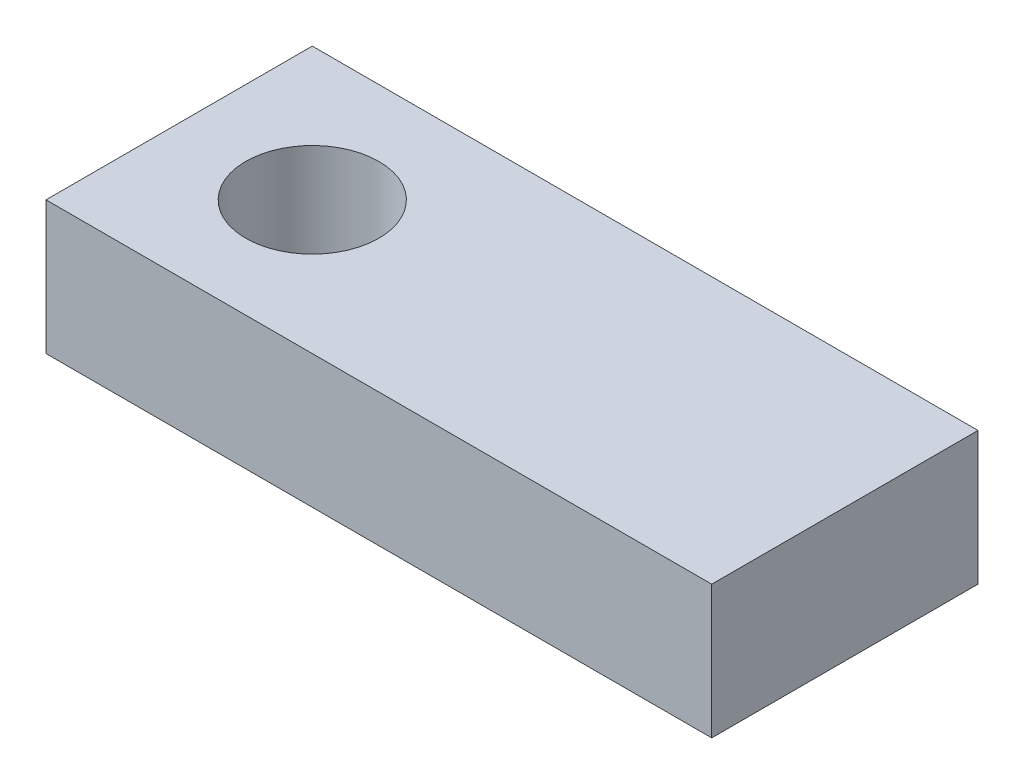
ISO-10303-21;
HEADER;
FILE_DESCRIPTION(('STEP AP214'),'2;1');
FILE_NAME('part.step','',(''),(''),'','','');
FILE_SCHEMA(('AUTOMOTIVE_DESIGN { 1 0 10303 214 1 1 1 1 }'));
ENDSEC;
DATA;
#1=APPLICATION_CONTEXT('core data for automotive mechanical design processes');
#2=APPLICATION_PROTOCOL_DEFINITION('international standard','automotive_design',2000,#1);
#3=PRODUCT_CONTEXT('',#1,'mechanical');
#4=PRODUCT('Part','Part','',(#3));
#5=PRODUCT_RELATED_PRODUCT_CATEGORY('part','',(#4));
#6=PRODUCT_DEFINITION_FORMATION('','',#4);
#7=PRODUCT_DEFINITION_CONTEXT('part definition',#1,'design');
#8=PRODUCT_DEFINITION('design','',#6,#7);
#9=PRODUCT_DEFINITION_SHAPE('','',#8);
#10=(LENGTH_UNIT() NAMED_UNIT(*) SI_UNIT(.MILLI.,.METRE.));
#11=(NAMED_UNIT(*) PLANE_ANGLE_UNIT() SI_UNIT($,.RADIAN.));
#12=(NAMED_UNIT(*) SI_UNIT($,.STERADIAN.) SOLID_ANGLE_UNIT());
#13=UNCERTAINTY_MEASURE_WITH_UNIT(LENGTH_MEASURE(1.E-05),#10,'distance_accuracy_value','');
#14=(GEOMETRIC_REPRESENTATION_CONTEXT(3) GLOBAL_UNCERTAINTY_ASSIGNED_CONTEXT((#13)) GLOBAL_UNIT_ASSIGNED_CONTEXT((#10,
#11,#12)) REPRESENTATION_CONTEXT('',''));
#15=CARTESIAN_POINT('',(0.,0.,0.));
#16=DIRECTION('',(0.,0.,1.));
#17=DIRECTION('',(1.,0.,0.));
#18=AXIS2_PLACEMENT_3D('',#15,#16,#17);
#19=CARTESIAN_POINT('',(0.,25.4,0.));
#20=DIRECTION('',(1.,0.,0.));
#21=DIRECTION('',(0.,0.,-1.));
#22=AXIS2_PLACEMENT_3D('',#19,#20,#21);
#23=PLANE('',#22);
#24=DIRECTION('',(0.,0.,1.));
#25=VECTOR('',#24,1.);
#26=CARTESIAN_POINT('',(0.,0.,0.));
#27=LINE('',#26,#25);
#28=CARTESIAN_POINT('',(0.,0.,-50.8));
#29=VERTEX_POINT('',#28);
#30=CARTESIAN_POINT('',(0.,0.,0.));
#31=VERTEX_POINT('',#30);
#32=EDGE_CURVE('E97',#29,#31,#27,.T.);
#33=ORIENTED_EDGE('',*,*,#32,.T.);
#34=DIRECTION('',(0.,-1.,0.));
#35=VECTOR('',#34,1.);
#36=CARTESIAN_POINT('',(0.,25.4,0.));
#37=LINE('',#36,#35);
#38=CARTESIAN_POINT('',(0.,25.4,0.));
#39=VERTEX_POINT('',#38);
#40=EDGE_CURVE('E11',#39,#31,#37,.T.);
#41=ORIENTED_EDGE('',*,*,#40,.F.);
#42=DIRECTION('',(0.,0.,1.));
#43=VECTOR('',#42,1.);
#44=CARTESIAN_POINT('',(0.,25.4,0.));
#45=LINE('',#44,#43);
#46=CARTESIAN_POINT('',(0.,25.4,-50.8));
#47=VERTEX_POINT('',#46);
#48=EDGE_CURVE('E85',#47,#39,#45,.T.);
#49=ORIENTED_EDGE('',*,*,#48,.F.);
#50=DIRECTION('',(0.,-1.,0.));
#51=VECTOR('',#50,1.);
#52=CARTESIAN_POINT('',(0.,25.4,-50.8));
#53=LINE('',#52,#51);
#54=EDGE_CURVE('E93',#47,#29,#53,.T.);
#55=ORIENTED_EDGE('',*,*,#54,.T.);
#56=EDGE_LOOP('',(#33,#41,#49,#55));
#57=FACE_BOUND('',#56,.T.);
#58=ADVANCED_FACE('F34',(#57),#23,.F.);
#59=CARTESIAN_POINT('',(0.,25.4,0.));
#60=DIRECTION('',(0.,0.,-1.));
#61=DIRECTION('',(-1.,0.,0.));
#62=AXIS2_PLACEMENT_3D('',#59,#60,#61);
#63=PLANE('',#62);
#64=DIRECTION('',(1.,0.,0.));
#65=VECTOR('',#64,1.);
#66=CARTESIAN_POINT('',(0.,0.,0.));
#67=LINE('',#66,#65);
#68=CARTESIAN_POINT('',(127.,0.,0.));
#69=VERTEX_POINT('',#68);
#70=EDGE_CURVE('E89',#31,#69,#67,.T.);
#71=ORIENTED_EDGE('',*,*,#70,.T.);
#72=DIRECTION('',(0.,-1.,0.));
#73=VECTOR('',#72,1.);
#74=CARTESIAN_POINT('',(127.,25.4,0.));
#75=LINE('',#74,#73);
#76=CARTESIAN_POINT('',(127.,25.4,0.));
#77=VERTEX_POINT('',#76);
#78=EDGE_CURVE('E42',#77,#69,#75,.T.);
#79=ORIENTED_EDGE('',*,*,#78,.F.);
#80=DIRECTION('',(1.,0.,0.));
#81=VECTOR('',#80,1.);
#82=CARTESIAN_POINT('',(0.,25.4,0.));
#83=LINE('',#82,#81);
#84=EDGE_CURVE('E80',#39,#77,#83,.T.);
#85=ORIENTED_EDGE('',*,*,#84,.F.);
#86=ORIENTED_EDGE('',*,*,#40,.T.);
#87=EDGE_LOOP('',(#71,#79,#85,#86));
#88=FACE_BOUND('',#87,.T.);
#89=ADVANCED_FACE('F88',(#88),#63,.F.);
#90=CARTESIAN_POINT('',(127.,25.4,0.));
#91=DIRECTION('',(-1.,0.,0.));
#92=DIRECTION('',(0.,0.,1.));
#93=AXIS2_PLACEMENT_3D('',#90,#91,#92);
#94=PLANE('',#93);
#95=DIRECTION('',(0.,0.,-1.));
#96=VECTOR('',#95,1.);
#97=CARTESIAN_POINT('',(127.,0.,0.));
#98=LINE('',#97,#96);
#99=CARTESIAN_POINT('',(127.,0.,-50.8));
#100=VERTEX_POINT('',#99);
#101=EDGE_CURVE('E67',#69,#100,#98,.T.);
#102=ORIENTED_EDGE('',*,*,#101,.T.);
#103=DIRECTION('',(0.,-1.,0.));
#104=VECTOR('',#103,1.);
#105=CARTESIAN_POINT('',(127.,25.4,-50.8));
#106=LINE('',#105,#104);
#107=CARTESIAN_POINT('',(127.,25.4,-50.8));
#108=VERTEX_POINT('',#107);
#109=EDGE_CURVE('E90',#108,#100,#106,.T.);
#110=ORIENTED_EDGE('',*,*,#109,.F.);
#111=DIRECTION('',(0.,0.,-1.));
#112=VECTOR('',#111,1.);
#113=CARTESIAN_POINT('',(127.,25.4,0.));
#114=LINE('',#113,#112);
#115=EDGE_CURVE('E83',#77,#108,#114,.T.);
#116=ORIENTED_EDGE('',*,*,#115,.F.);
#117=ORIENTED_EDGE('',*,*,#78,.T.);
#118=EDGE_LOOP('',(#102,#110,#116,#117));
#119=FACE_BOUND('',#118,.T.);
#120=ADVANCED_FACE('F91',(#119),#94,.F.);
#121=CARTESIAN_POINT('',(0.,25.4,-50.8));
#122=DIRECTION('',(0.,0.,1.));
#123=DIRECTION('',(1.,0.,0.));
#124=AXIS2_PLACEMENT_3D('',#121,#122,#123);
#125=PLANE('',#124);
#126=DIRECTION('',(-1.,0.,0.));
#127=VECTOR('',#126,1.);
#128=CARTESIAN_POINT('',(0.,0.,-50.8));
#129=LINE('',#128,#127);
#130=EDGE_CURVE('E73',#100,#29,#129,.T.);
#131=ORIENTED_EDGE('',*,*,#130,.T.);
#132=ORIENTED_EDGE('',*,*,#54,.F.);
#133=DIRECTION('',(-1.,0.,0.));
#134=VECTOR('',#133,1.);
#135=CARTESIAN_POINT('',(0.,25.4,-50.8));
#136=LINE('',#135,#134);
#137=EDGE_CURVE('E50',#108,#47,#136,.T.);
#138=ORIENTED_EDGE('',*,*,#137,.F.);
#139=ORIENTED_EDGE('',*,*,#109,.T.);
#140=EDGE_LOOP('',(#131,#132,#138,#139));
#141=FACE_BOUND('',#140,.T.);
#142=ADVANCED_FACE('F105',(#141),#125,.F.);
#143=CARTESIAN_POINT('',(0.,25.4,-50.8));
#144=DIRECTION('',(0.,-1.,0.));
#145=DIRECTION('',(0.,0.,-1.));
#146=AXIS2_PLACEMENT_3D('',#143,#144,#145);
#147=PLANE('',#146);
#148=CARTESIAN_POINT('',(25.4,25.4,-25.4));
#149=DIRECTION('',(0.,-1.,0.));
#150=DIRECTION('',(0.,0.,-1.));
#151=AXIS2_PLACEMENT_3D('',#148,#149,#150);
#152=CIRCLE('',#151,12.7);
#153=CARTESIAN_POINT('',(25.4,25.4,-38.1));
#154=VERTEX_POINT('',#153);
#155=EDGE_CURVE('E100',#154,#154,#152,.F.);
#156=ORIENTED_EDGE('',*,*,#155,.F.);
#157=EDGE_LOOP('',(#156));
#158=FACE_BOUND('',#157,.T.);
#159=ORIENTED_EDGE('',*,*,#48,.T.);
#160=ORIENTED_EDGE('',*,*,#84,.T.);
#161=ORIENTED_EDGE('',*,*,#115,.T.);
#162=ORIENTED_EDGE('',*,*,#137,.T.);
#163=EDGE_LOOP('',(#159,#160,#161,#162));
#164=FACE_BOUND('',#163,.T.);
#165=ADVANCED_FACE('F81',(#158,#164),#147,.F.);
#166=CARTESIAN_POINT('',(0.,0.,-50.8));
#167=DIRECTION('',(0.,-1.,0.));
#168=DIRECTION('',(0.,0.,-1.));
#169=AXIS2_PLACEMENT_3D('',#166,#167,#168);
#170=PLANE('',#169);
#171=CARTESIAN_POINT('',(25.4,0.,-25.4));
#172=DIRECTION('',(0.,-1.,0.));
#173=DIRECTION('',(0.,0.,-1.));
#174=AXIS2_PLACEMENT_3D('',#171,#172,#173);
#175=CIRCLE('',#174,12.7);
#176=CARTESIAN_POINT('',(25.4,0.,-38.1));
#177=VERTEX_POINT('',#176);
#178=EDGE_CURVE('E113',#177,#177,#175,.T.);
#179=ORIENTED_EDGE('',*,*,#178,.F.);
#180=EDGE_LOOP('',(#179));
#181=FACE_BOUND('',#180,.T.);
#182=ORIENTED_EDGE('',*,*,#32,.F.);
#183=ORIENTED_EDGE('',*,*,#130,.F.);
#184=ORIENTED_EDGE('',*,*,#101,.F.);
#185=ORIENTED_EDGE('',*,*,#70,.F.);
#186=EDGE_LOOP('',(#182,#183,#184,#185));
#187=FACE_BOUND('',#186,.T.);
#188=ADVANCED_FACE('F108',(#181,#187),#170,.T.);
#189=CARTESIAN_POINT('',(25.4,25.401,-25.4));
#190=DIRECTION('',(0.,-1.,0.));
#191=DIRECTION('',(0.,0.,-1.));
#192=AXIS2_PLACEMENT_3D('',#189,#190,#191);
#193=CYLINDRICAL_SURFACE('',#192,12.7);
#194=ORIENTED_EDGE('',*,*,#178,.T.);
#195=EDGE_LOOP('',(#194));
#196=FACE_BOUND('',#195,.T.);
#197=ORIENTED_EDGE('',*,*,#155,.T.);
#198=EDGE_LOOP('',(#197));
#199=FACE_BOUND('',#198,.T.);
#200=ADVANCED_FACE('F117',(#196,#199),#193,.F.);
#201=CLOSED_SHELL('',(#58,#89,#120,#142,#165,#188,#200));
#202=MANIFOLD_SOLID_BREP('B2',#201);
#203=ADVANCED_BREP_SHAPE_REPRESENTATION('',(#18,#202),#14);
#204=SHAPE_DEFINITION_REPRESENTATION(#9,#203);
ENDSEC;
END-ISO-10303-21;
